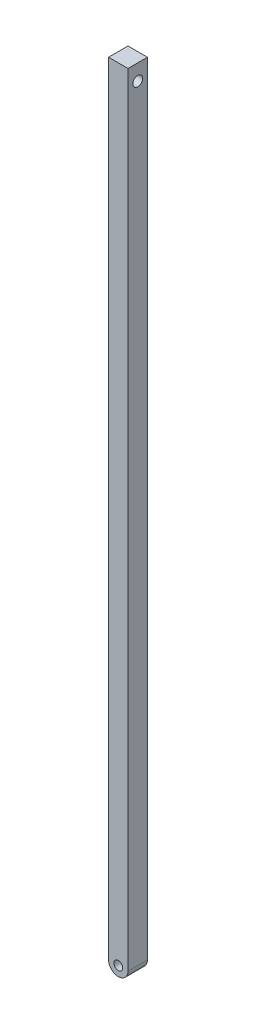
ISO-10303-21;
HEADER;
FILE_DESCRIPTION(('STEP AP214'),'2;1');
FILE_NAME('part.step','',(''),(''),'','','');
FILE_SCHEMA(('AUTOMOTIVE_DESIGN { 1 0 10303 214 1 1 1 1 }'));
ENDSEC;
DATA;
#1=APPLICATION_CONTEXT('core data for automotive mechanical design processes');
#2=APPLICATION_PROTOCOL_DEFINITION('international standard','automotive_design',2000,#1);
#3=PRODUCT_CONTEXT('',#1,'mechanical');
#4=PRODUCT('Part','Part','',(#3));
#5=PRODUCT_RELATED_PRODUCT_CATEGORY('part','',(#4));
#6=PRODUCT_DEFINITION_FORMATION('','',#4);
#7=PRODUCT_DEFINITION_CONTEXT('part definition',#1,'design');
#8=PRODUCT_DEFINITION('design','',#6,#7);
#9=PRODUCT_DEFINITION_SHAPE('','',#8);
#10=(LENGTH_UNIT() NAMED_UNIT(*) SI_UNIT(.MILLI.,.METRE.));
#11=(NAMED_UNIT(*) PLANE_ANGLE_UNIT() SI_UNIT($,.RADIAN.));
#12=(NAMED_UNIT(*) SI_UNIT($,.STERADIAN.) SOLID_ANGLE_UNIT());
#13=UNCERTAINTY_MEASURE_WITH_UNIT(LENGTH_MEASURE(1.E-05),#10,'distance_accuracy_value','');
#14=(GEOMETRIC_REPRESENTATION_CONTEXT(3) GLOBAL_UNCERTAINTY_ASSIGNED_CONTEXT((#13)) GLOBAL_UNIT_ASSIGNED_CONTEXT((#10,
#11,#12)) REPRESENTATION_CONTEXT('',''));
#15=CARTESIAN_POINT('',(0.,0.,0.));
#16=DIRECTION('',(0.,0.,1.));
#17=DIRECTION('',(1.,0.,0.));
#18=AXIS2_PLACEMENT_3D('',#15,#16,#17);
#19=CARTESIAN_POINT('',(3.94382586025072,-66.756132879046,1.));
#20=DIRECTION('',(0.,0.,1.));
#21=DIRECTION('',(1.,0.,0.));
#22=AXIS2_PLACEMENT_3D('',#19,#20,#21);
#23=PLANE('',#22);
#24=DIRECTION('',(0.,-1.,0.));
#25=VECTOR('',#24,1.);
#26=CARTESIAN_POINT('',(3.44382586025072,-27.356132879046,1.));
#27=LINE('',#26,#25);
#28=CARTESIAN_POINT('',(3.44382586025072,-26.5411343558413,1.));
#29=VERTEX_POINT('',#28);
#30=CARTESIAN_POINT('',(3.44382586025073,-66.756132879046,1.));
#31=VERTEX_POINT('',#30);
#32=EDGE_CURVE('E83',#29,#31,#27,.T.);
#33=ORIENTED_EDGE('',*,*,#32,.T.);
#34=CARTESIAN_POINT('',(3.94382586025072,-66.756132879046,1.));
#35=DIRECTION('',(0.,0.,1.));
#36=DIRECTION('',(1.,0.,0.));
#37=AXIS2_PLACEMENT_3D('',#34,#35,#36);
#38=CIRCLE('',#37,0.499999999999995);
#39=CARTESIAN_POINT('',(4.44382586025072,-66.756132879046,1.));
#40=VERTEX_POINT('',#39);
#41=EDGE_CURVE('E86',#31,#40,#38,.T.);
#42=ORIENTED_EDGE('',*,*,#41,.T.);
#43=DIRECTION('',(0.,1.,0.));
#44=VECTOR('',#43,1.);
#45=CARTESIAN_POINT('',(4.44382586025072,-27.356132879046,1.));
#46=LINE('',#45,#44);
#47=CARTESIAN_POINT('',(4.44382586025072,-26.5411343558413,1.));
#48=VERTEX_POINT('',#47);
#49=EDGE_CURVE('E90',#40,#48,#46,.T.);
#50=ORIENTED_EDGE('',*,*,#49,.T.);
#51=DIRECTION('',(-1.,0.,0.));
#52=VECTOR('',#51,1.);
#53=CARTESIAN_POINT('',(3.44382586025072,-26.5411343558413,1.));
#54=LINE('',#53,#52);
#55=EDGE_CURVE('E55',#48,#29,#54,.T.);
#56=ORIENTED_EDGE('',*,*,#55,.T.);
#57=EDGE_LOOP('',(#33,#42,#50,#56));
#58=FACE_BOUND('',#57,.T.);
#59=CARTESIAN_POINT('',(3.94382586025072,-66.756132879046,1.));
#60=DIRECTION('',(0.,0.,1.));
#61=DIRECTION('',(1.,0.,0.));
#62=AXIS2_PLACEMENT_3D('',#59,#60,#61);
#63=CIRCLE('',#62,0.227761076804637);
#64=CARTESIAN_POINT('',(4.17158693705536,-66.756132879046,1.));
#65=VERTEX_POINT('',#64);
#66=EDGE_CURVE('E104',#65,#65,#63,.T.);
#67=ORIENTED_EDGE('',*,*,#66,.F.);
#68=EDGE_LOOP('',(#67));
#69=FACE_BOUND('',#68,.T.);
#70=ADVANCED_FACE('F38',(#58,#69),#23,.T.);
#71=CARTESIAN_POINT('',(3.94382586025072,-66.756132879046,0.));
#72=DIRECTION('',(0.,0.,1.));
#73=DIRECTION('',(1.,0.,0.));
#74=AXIS2_PLACEMENT_3D('',#71,#72,#73);
#75=PLANE('',#74);
#76=DIRECTION('',(0.,-1.,0.));
#77=VECTOR('',#76,1.);
#78=CARTESIAN_POINT('',(3.44382586025072,-27.356132879046,0.));
#79=LINE('',#78,#77);
#80=CARTESIAN_POINT('',(3.44382586025072,-26.5411343558413,0.));
#81=VERTEX_POINT('',#80);
#82=CARTESIAN_POINT('',(3.44382586025073,-66.756132879046,0.));
#83=VERTEX_POINT('',#82);
#84=EDGE_CURVE('E78',#81,#83,#79,.T.);
#85=ORIENTED_EDGE('',*,*,#84,.F.);
#86=DIRECTION('',(-1.,0.,0.));
#87=VECTOR('',#86,1.);
#88=CARTESIAN_POINT('',(3.44382586025072,-26.5411343558413,0.));
#89=LINE('',#88,#87);
#90=CARTESIAN_POINT('',(4.44382586025072,-26.5411343558413,0.));
#91=VERTEX_POINT('',#90);
#92=EDGE_CURVE('E107',#91,#81,#89,.T.);
#93=ORIENTED_EDGE('',*,*,#92,.F.);
#94=DIRECTION('',(0.,1.,0.));
#95=VECTOR('',#94,1.);
#96=CARTESIAN_POINT('',(4.44382586025072,-26.5411343558413,0.));
#97=LINE('',#96,#95);
#98=CARTESIAN_POINT('',(4.44382586025072,-66.756132879046,0.));
#99=VERTEX_POINT('',#98);
#100=EDGE_CURVE('E71',#99,#91,#97,.T.);
#101=ORIENTED_EDGE('',*,*,#100,.F.);
#102=CARTESIAN_POINT('',(3.94382586025072,-66.756132879046,0.));
#103=DIRECTION('',(0.,0.,1.));
#104=DIRECTION('',(1.,0.,0.));
#105=AXIS2_PLACEMENT_3D('',#102,#103,#104);
#106=CIRCLE('',#105,0.499999999999995);
#107=EDGE_CURVE('E95',#83,#99,#106,.T.);
#108=ORIENTED_EDGE('',*,*,#107,.F.);
#109=EDGE_LOOP('',(#85,#93,#101,#108));
#110=FACE_BOUND('',#109,.T.);
#111=CARTESIAN_POINT('',(3.94382586025072,-66.756132879046,0.));
#112=DIRECTION('',(0.,0.,1.));
#113=DIRECTION('',(1.,0.,0.));
#114=AXIS2_PLACEMENT_3D('',#111,#112,#113);
#115=CIRCLE('',#114,0.227761076804637);
#116=CARTESIAN_POINT('',(4.17158693705536,-66.756132879046,0.));
#117=VERTEX_POINT('',#116);
#118=EDGE_CURVE('E119',#117,#117,#115,.T.);
#119=ORIENTED_EDGE('',*,*,#118,.T.);
#120=EDGE_LOOP('',(#119));
#121=FACE_BOUND('',#120,.T.);
#122=ADVANCED_FACE('F113',(#110,#121),#75,.F.);
#123=CARTESIAN_POINT('',(3.44382586025072,-27.356132879046,1.));
#124=DIRECTION('',(1.,0.,0.));
#125=DIRECTION('',(0.,1.,0.));
#126=AXIS2_PLACEMENT_3D('',#123,#124,#125);
#127=PLANE('',#126);
#128=CARTESIAN_POINT('',(3.44382586025072,-27.356132879046,0.5));
#129=DIRECTION('',(1.,0.,0.));
#130=DIRECTION('',(0.,1.,0.));
#131=AXIS2_PLACEMENT_3D('',#128,#129,#130);
#132=CIRCLE('',#131,0.251968503896492);
#133=CARTESIAN_POINT('',(3.44382586025072,-27.1041643751495,0.5));
#134=VERTEX_POINT('',#133);
#135=EDGE_CURVE('E121',#134,#134,#132,.T.);
#136=ORIENTED_EDGE('',*,*,#135,.T.);
#137=EDGE_LOOP('',(#136));
#138=FACE_BOUND('',#137,.T.);
#139=ORIENTED_EDGE('',*,*,#84,.T.);
#140=DIRECTION('',(0.,0.,-1.));
#141=VECTOR('',#140,1.);
#142=CARTESIAN_POINT('',(3.44382586025073,-66.756132879046,1.));
#143=LINE('',#142,#141);
#144=EDGE_CURVE('E11',#31,#83,#143,.T.);
#145=ORIENTED_EDGE('',*,*,#144,.F.);
#146=ORIENTED_EDGE('',*,*,#32,.F.);
#147=DIRECTION('',(0.,0.,-1.));
#148=VECTOR('',#147,1.);
#149=CARTESIAN_POINT('',(3.44382586025072,-26.5411343558413,1.));
#150=LINE('',#149,#148);
#151=EDGE_CURVE('E99',#29,#81,#150,.T.);
#152=ORIENTED_EDGE('',*,*,#151,.T.);
#153=EDGE_LOOP('',(#139,#145,#146,#152));
#154=FACE_BOUND('',#153,.T.);
#155=ADVANCED_FACE('F40',(#138,#154),#127,.F.);
#156=CARTESIAN_POINT('',(3.94382586025072,-66.756132879046,1.));
#157=DIRECTION('',(0.,0.,-1.));
#158=DIRECTION('',(-1.,0.,0.));
#159=AXIS2_PLACEMENT_3D('',#156,#157,#158);
#160=CYLINDRICAL_SURFACE('',#159,0.499999999999995);
#161=ORIENTED_EDGE('',*,*,#107,.T.);
#162=DIRECTION('',(0.,0.,-1.));
#163=VECTOR('',#162,1.);
#164=CARTESIAN_POINT('',(4.44382586025072,-66.756132879046,1.));
#165=LINE('',#164,#163);
#166=EDGE_CURVE('E47',#40,#99,#165,.T.);
#167=ORIENTED_EDGE('',*,*,#166,.F.);
#168=ORIENTED_EDGE('',*,*,#41,.F.);
#169=ORIENTED_EDGE('',*,*,#144,.T.);
#170=EDGE_LOOP('',(#161,#167,#168,#169));
#171=FACE_BOUND('',#170,.T.);
#172=ADVANCED_FACE('F94',(#171),#160,.T.);
#173=CARTESIAN_POINT('',(4.44382586025072,-26.5411343558413,1.));
#174=DIRECTION('',(-1.,0.,0.));
#175=DIRECTION('',(0.,0.,1.));
#176=AXIS2_PLACEMENT_3D('',#173,#174,#175);
#177=PLANE('',#176);
#178=CARTESIAN_POINT('',(4.44382586025072,-27.356132879046,0.5));
#179=DIRECTION('',(1.,0.,0.));
#180=DIRECTION('',(0.,0.,-1.));
#181=AXIS2_PLACEMENT_3D('',#178,#179,#180);
#182=CIRCLE('',#181,0.251968503896492);
#183=CARTESIAN_POINT('',(4.44382586025072,-27.356132879046,0.248031496103508));
#184=VERTEX_POINT('',#183);
#185=EDGE_CURVE('E126',#184,#184,#182,.T.);
#186=ORIENTED_EDGE('',*,*,#185,.F.);
#187=EDGE_LOOP('',(#186));
#188=FACE_BOUND('',#187,.T.);
#189=ORIENTED_EDGE('',*,*,#100,.T.);
#190=DIRECTION('',(0.,0.,-1.));
#191=VECTOR('',#190,1.);
#192=CARTESIAN_POINT('',(4.44382586025072,-26.5411343558413,1.));
#193=LINE('',#192,#191);
#194=EDGE_CURVE('E96',#48,#91,#193,.T.);
#195=ORIENTED_EDGE('',*,*,#194,.F.);
#196=ORIENTED_EDGE('',*,*,#49,.F.);
#197=ORIENTED_EDGE('',*,*,#166,.T.);
#198=EDGE_LOOP('',(#189,#195,#196,#197));
#199=FACE_BOUND('',#198,.T.);
#200=ADVANCED_FACE('F97',(#188,#199),#177,.F.);
#201=CARTESIAN_POINT('',(3.44382586025072,-26.5411343558413,1.));
#202=DIRECTION('',(0.,-1.,0.));
#203=DIRECTION('',(0.,0.,-1.));
#204=AXIS2_PLACEMENT_3D('',#201,#202,#203);
#205=PLANE('',#204);
#206=ORIENTED_EDGE('',*,*,#92,.T.);
#207=ORIENTED_EDGE('',*,*,#151,.F.);
#208=ORIENTED_EDGE('',*,*,#55,.F.);
#209=ORIENTED_EDGE('',*,*,#194,.T.);
#210=EDGE_LOOP('',(#206,#207,#208,#209));
#211=FACE_BOUND('',#210,.T.);
#212=ADVANCED_FACE('F112',(#211),#205,.F.);
#213=CARTESIAN_POINT('',(3.94382586025072,-66.756132879046,1.));
#214=DIRECTION('',(0.,0.,-1.));
#215=DIRECTION('',(-1.,0.,0.));
#216=AXIS2_PLACEMENT_3D('',#213,#214,#215);
#217=CYLINDRICAL_SURFACE('',#216,0.227761076804637);
#218=ORIENTED_EDGE('',*,*,#66,.T.);
#219=EDGE_LOOP('',(#218));
#220=FACE_BOUND('',#219,.T.);
#221=ORIENTED_EDGE('',*,*,#118,.F.);
#222=EDGE_LOOP('',(#221));
#223=FACE_BOUND('',#222,.T.);
#224=ADVANCED_FACE('F141',(#220,#223),#217,.F.);
#225=CARTESIAN_POINT('',(-5.55617413974928,-27.356132879046,0.5));
#226=DIRECTION('',(1.,0.,0.));
#227=DIRECTION('',(0.,0.,-1.));
#228=AXIS2_PLACEMENT_3D('',#225,#226,#227);
#229=CYLINDRICAL_SURFACE('',#228,0.251968503896492);
#230=ORIENTED_EDGE('',*,*,#185,.T.);
#231=EDGE_LOOP('',(#230));
#232=FACE_BOUND('',#231,.T.);
#233=ORIENTED_EDGE('',*,*,#135,.F.);
#234=EDGE_LOOP('',(#233));
#235=FACE_BOUND('',#234,.T.);
#236=ADVANCED_FACE('F132',(#232,#235),#229,.F.);
#237=CLOSED_SHELL('',(#70,#122,#155,#172,#200,#212,#224,#236));
#238=MANIFOLD_SOLID_BREP('B2',#237);
#239=ADVANCED_BREP_SHAPE_REPRESENTATION('',(#18,#238),#14);
#240=SHAPE_DEFINITION_REPRESENTATION(#9,#239);
ENDSEC;
END-ISO-10303-21;
